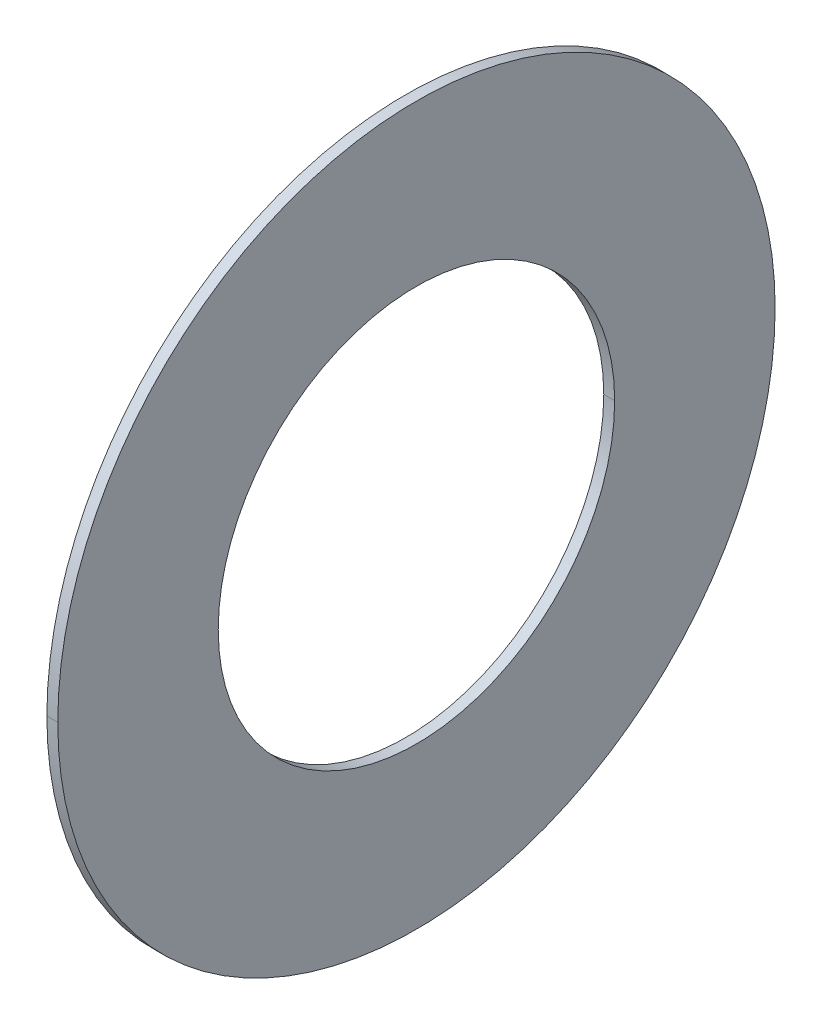
ISO-10303-21;
HEADER;
FILE_DESCRIPTION(('STEP AP214'),'2;1');
FILE_NAME('part.step','',(''),(''),'','','');
FILE_SCHEMA(('AUTOMOTIVE_DESIGN { 1 0 10303 214 1 1 1 1 }'));
ENDSEC;
DATA;
#1=APPLICATION_CONTEXT('core data for automotive mechanical design processes');
#2=APPLICATION_PROTOCOL_DEFINITION('international standard','automotive_design',2000,#1);
#3=PRODUCT_CONTEXT('',#1,'mechanical');
#4=PRODUCT('Part','Part','',(#3));
#5=PRODUCT_RELATED_PRODUCT_CATEGORY('part','',(#4));
#6=PRODUCT_DEFINITION_FORMATION('','',#4);
#7=PRODUCT_DEFINITION_CONTEXT('part definition',#1,'design');
#8=PRODUCT_DEFINITION('design','',#6,#7);
#9=PRODUCT_DEFINITION_SHAPE('','',#8);
#10=(LENGTH_UNIT() NAMED_UNIT(*) SI_UNIT(.MILLI.,.METRE.));
#11=(NAMED_UNIT(*) PLANE_ANGLE_UNIT() SI_UNIT($,.RADIAN.));
#12=(NAMED_UNIT(*) SI_UNIT($,.STERADIAN.) SOLID_ANGLE_UNIT());
#13=UNCERTAINTY_MEASURE_WITH_UNIT(LENGTH_MEASURE(1.E-05),#10,'distance_accuracy_value','');
#14=(GEOMETRIC_REPRESENTATION_CONTEXT(3) GLOBAL_UNCERTAINTY_ASSIGNED_CONTEXT((#13)) GLOBAL_UNIT_ASSIGNED_CONTEXT((#10,
#11,#12)) REPRESENTATION_CONTEXT('',''));
#15=CARTESIAN_POINT('',(0.,0.,0.));
#16=DIRECTION('',(0.,0.,1.));
#17=DIRECTION('',(1.,0.,0.));
#18=AXIS2_PLACEMENT_3D('',#15,#16,#17);
#19=CARTESIAN_POINT('',(0.385,9.5,0.));
#20=DIRECTION('',(-1.,0.,0.));
#21=DIRECTION('',(0.,0.,1.));
#22=AXIS2_PLACEMENT_3D('',#19,#20,#21);
#23=PLANE('',#22);
#24=CARTESIAN_POINT('',(0.385,0.,0.));
#25=DIRECTION('',(1.,0.,0.));
#26=DIRECTION('',(0.,0.,-1.));
#27=AXIS2_PLACEMENT_3D('',#24,#25,#26);
#28=CIRCLE('',#27,5.25);
#29=CARTESIAN_POINT('',(0.385,0.,-5.25));
#30=VERTEX_POINT('',#29);
#31=CARTESIAN_POINT('',(0.385,0.,5.25));
#32=VERTEX_POINT('',#31);
#33=EDGE_CURVE('E11',#30,#32,#28,.T.);
#34=ORIENTED_EDGE('',*,*,#33,.T.);
#35=CARTESIAN_POINT('',(0.385,0.,0.));
#36=DIRECTION('',(1.,0.,0.));
#37=DIRECTION('',(0.,0.,-1.));
#38=AXIS2_PLACEMENT_3D('',#35,#36,#37);
#39=CIRCLE('',#38,5.25);
#40=EDGE_CURVE('E25',#32,#30,#39,.T.);
#41=ORIENTED_EDGE('',*,*,#40,.T.);
#42=EDGE_LOOP('',(#34,#41));
#43=FACE_BOUND('',#42,.T.);
#44=CARTESIAN_POINT('',(0.385,0.,0.));
#45=DIRECTION('',(1.,0.,0.));
#46=DIRECTION('',(0.,0.,-1.));
#47=AXIS2_PLACEMENT_3D('',#44,#45,#46);
#48=CIRCLE('',#47,9.5);
#49=CARTESIAN_POINT('',(0.385,0.,9.5));
#50=VERTEX_POINT('',#49);
#51=CARTESIAN_POINT('',(0.385,0.,-9.5));
#52=VERTEX_POINT('',#51);
#53=EDGE_CURVE('E95',#50,#52,#48,.T.);
#54=ORIENTED_EDGE('',*,*,#53,.F.);
#55=CARTESIAN_POINT('',(0.385,0.,0.));
#56=DIRECTION('',(1.,0.,0.));
#57=DIRECTION('',(0.,0.,-1.));
#58=AXIS2_PLACEMENT_3D('',#55,#56,#57);
#59=CIRCLE('',#58,9.5);
#60=EDGE_CURVE('E90',#52,#50,#59,.T.);
#61=ORIENTED_EDGE('',*,*,#60,.F.);
#62=EDGE_LOOP('',(#54,#61));
#63=FACE_BOUND('',#62,.T.);
#64=ADVANCED_FACE('F17',(#43,#63),#23,.T.);
#65=CARTESIAN_POINT('',(0.67375,0.,0.));
#66=DIRECTION('',(1.,0.,0.));
#67=DIRECTION('',(0.,-1.,0.));
#68=AXIS2_PLACEMENT_3D('',#65,#66,#67);
#69=CYLINDRICAL_SURFACE('',#68,9.5);
#70=DIRECTION('',(1.,0.,0.));
#71=VECTOR('',#70,1.);
#72=CARTESIAN_POINT('',(0.385,0.,9.5));
#73=LINE('',#72,#71);
#74=CARTESIAN_POINT('',(0.67375,0.,9.5));
#75=VERTEX_POINT('',#74);
#76=EDGE_CURVE('E86',#50,#75,#73,.T.);
#77=ORIENTED_EDGE('',*,*,#76,.T.);
#78=CARTESIAN_POINT('',(0.67375,0.,0.));
#79=DIRECTION('',(1.,0.,0.));
#80=DIRECTION('',(0.,0.,-1.));
#81=AXIS2_PLACEMENT_3D('',#78,#79,#80);
#82=CIRCLE('',#81,9.5);
#83=CARTESIAN_POINT('',(0.67375,0.,-9.5));
#84=VERTEX_POINT('',#83);
#85=EDGE_CURVE('E81',#84,#75,#82,.T.);
#86=ORIENTED_EDGE('',*,*,#85,.F.);
#87=DIRECTION('',(1.,0.,0.));
#88=VECTOR('',#87,1.);
#89=CARTESIAN_POINT('',(0.385,0.,-9.5));
#90=LINE('',#89,#88);
#91=EDGE_CURVE('E70',#52,#84,#90,.T.);
#92=ORIENTED_EDGE('',*,*,#91,.F.);
#93=ORIENTED_EDGE('',*,*,#60,.T.);
#94=EDGE_LOOP('',(#77,#86,#92,#93));
#95=FACE_BOUND('',#94,.T.);
#96=ADVANCED_FACE('F111',(#95),#69,.T.);
#97=CARTESIAN_POINT('',(0.67375,0.,0.));
#98=DIRECTION('',(1.,0.,0.));
#99=DIRECTION('',(0.,1.,0.));
#100=AXIS2_PLACEMENT_3D('',#97,#98,#99);
#101=CYLINDRICAL_SURFACE('',#100,9.5);
#102=ORIENTED_EDGE('',*,*,#76,.F.);
#103=ORIENTED_EDGE('',*,*,#53,.T.);
#104=ORIENTED_EDGE('',*,*,#91,.T.);
#105=CARTESIAN_POINT('',(0.67375,0.,0.));
#106=DIRECTION('',(1.,0.,0.));
#107=DIRECTION('',(0.,0.,-1.));
#108=AXIS2_PLACEMENT_3D('',#105,#106,#107);
#109=CIRCLE('',#108,9.5);
#110=EDGE_CURVE('E67',#75,#84,#109,.T.);
#111=ORIENTED_EDGE('',*,*,#110,.F.);
#112=EDGE_LOOP('',(#102,#103,#104,#111));
#113=FACE_BOUND('',#112,.T.);
#114=ADVANCED_FACE('F106',(#113),#101,.T.);
#115=CARTESIAN_POINT('',(0.67375,5.25,0.));
#116=DIRECTION('',(1.,0.,0.));
#117=DIRECTION('',(0.,0.,-1.));
#118=AXIS2_PLACEMENT_3D('',#115,#116,#117);
#119=PLANE('',#118);
#120=ORIENTED_EDGE('',*,*,#85,.T.);
#121=ORIENTED_EDGE('',*,*,#110,.T.);
#122=EDGE_LOOP('',(#120,#121));
#123=FACE_BOUND('',#122,.T.);
#124=CARTESIAN_POINT('',(0.67375,0.,0.));
#125=DIRECTION('',(1.,0.,0.));
#126=DIRECTION('',(0.,0.,-1.));
#127=AXIS2_PLACEMENT_3D('',#124,#125,#126);
#128=CIRCLE('',#127,5.25);
#129=CARTESIAN_POINT('',(0.67375,0.,5.25));
#130=VERTEX_POINT('',#129);
#131=CARTESIAN_POINT('',(0.67375,0.,-5.25));
#132=VERTEX_POINT('',#131);
#133=EDGE_CURVE('E55',#130,#132,#128,.T.);
#134=ORIENTED_EDGE('',*,*,#133,.F.);
#135=CARTESIAN_POINT('',(0.67375,0.,0.));
#136=DIRECTION('',(1.,0.,0.));
#137=DIRECTION('',(0.,0.,-1.));
#138=AXIS2_PLACEMENT_3D('',#135,#136,#137);
#139=CIRCLE('',#138,5.25);
#140=EDGE_CURVE('E51',#132,#130,#139,.T.);
#141=ORIENTED_EDGE('',*,*,#140,.F.);
#142=EDGE_LOOP('',(#134,#141));
#143=FACE_BOUND('',#142,.T.);
#144=ADVANCED_FACE('F53',(#123,#143),#119,.T.);
#145=CARTESIAN_POINT('',(0.67375,0.,0.));
#146=DIRECTION('',(1.,0.,0.));
#147=DIRECTION('',(0.,-1.,0.));
#148=AXIS2_PLACEMENT_3D('',#145,#146,#147);
#149=CYLINDRICAL_SURFACE('',#148,5.25);
#150=DIRECTION('',(1.,0.,0.));
#151=VECTOR('',#150,1.);
#152=CARTESIAN_POINT('',(0.385,0.,5.25));
#153=LINE('',#152,#151);
#154=EDGE_CURVE('E59',#32,#130,#153,.T.);
#155=ORIENTED_EDGE('',*,*,#154,.F.);
#156=ORIENTED_EDGE('',*,*,#33,.F.);
#157=DIRECTION('',(1.,0.,0.));
#158=VECTOR('',#157,1.);
#159=CARTESIAN_POINT('',(0.385,0.,-5.25));
#160=LINE('',#159,#158);
#161=EDGE_CURVE('E62',#30,#132,#160,.T.);
#162=ORIENTED_EDGE('',*,*,#161,.T.);
#163=ORIENTED_EDGE('',*,*,#140,.T.);
#164=EDGE_LOOP('',(#155,#156,#162,#163));
#165=FACE_BOUND('',#164,.T.);
#166=ADVANCED_FACE('F63',(#165),#149,.F.);
#167=CARTESIAN_POINT('',(0.67375,0.,0.));
#168=DIRECTION('',(1.,0.,0.));
#169=DIRECTION('',(0.,1.,0.));
#170=AXIS2_PLACEMENT_3D('',#167,#168,#169);
#171=CYLINDRICAL_SURFACE('',#170,5.25);
#172=ORIENTED_EDGE('',*,*,#154,.T.);
#173=ORIENTED_EDGE('',*,*,#133,.T.);
#174=ORIENTED_EDGE('',*,*,#161,.F.);
#175=ORIENTED_EDGE('',*,*,#40,.F.);
#176=EDGE_LOOP('',(#172,#173,#174,#175));
#177=FACE_BOUND('',#176,.T.);
#178=ADVANCED_FACE('F66',(#177),#171,.F.);
#179=CLOSED_SHELL('',(#64,#96,#114,#144,#166,#178));
#180=MANIFOLD_SOLID_BREP('B1',#179);
#181=ADVANCED_BREP_SHAPE_REPRESENTATION('',(#18,#180),#14);
#182=SHAPE_DEFINITION_REPRESENTATION(#9,#181);
ENDSEC;
END-ISO-10303-21;
